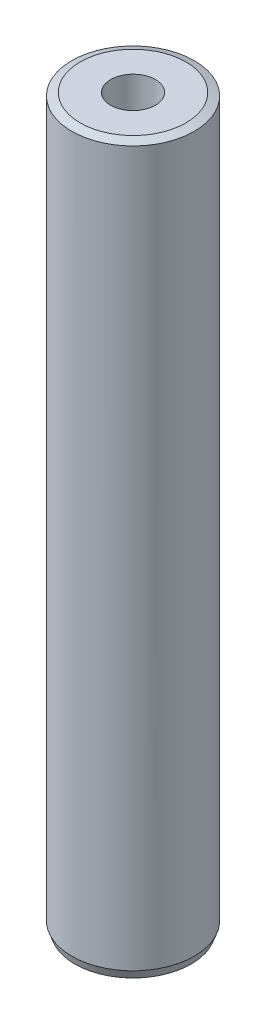
ISO-10303-21;
HEADER;
FILE_DESCRIPTION(('STEP AP214'),'2;1');
FILE_NAME('part.step','',(''),(''),'','','');
FILE_SCHEMA(('AUTOMOTIVE_DESIGN { 1 0 10303 214 1 1 1 1 }'));
ENDSEC;
DATA;
#1=APPLICATION_CONTEXT('core data for automotive mechanical design processes');
#2=APPLICATION_PROTOCOL_DEFINITION('international standard','automotive_design',2000,#1);
#3=PRODUCT_CONTEXT('',#1,'mechanical');
#4=PRODUCT('Part','Part','',(#3));
#5=PRODUCT_RELATED_PRODUCT_CATEGORY('part','',(#4));
#6=PRODUCT_DEFINITION_FORMATION('','',#4);
#7=PRODUCT_DEFINITION_CONTEXT('part definition',#1,'design');
#8=PRODUCT_DEFINITION('design','',#6,#7);
#9=PRODUCT_DEFINITION_SHAPE('','',#8);
#10=(LENGTH_UNIT() NAMED_UNIT(*) SI_UNIT(.MILLI.,.METRE.));
#11=(NAMED_UNIT(*) PLANE_ANGLE_UNIT() SI_UNIT($,.RADIAN.));
#12=(NAMED_UNIT(*) SI_UNIT($,.STERADIAN.) SOLID_ANGLE_UNIT());
#13=UNCERTAINTY_MEASURE_WITH_UNIT(LENGTH_MEASURE(1.E-05),#10,'distance_accuracy_value','');
#14=(GEOMETRIC_REPRESENTATION_CONTEXT(3) GLOBAL_UNCERTAINTY_ASSIGNED_CONTEXT((#13)) GLOBAL_UNIT_ASSIGNED_CONTEXT((#10,
#11,#12)) REPRESENTATION_CONTEXT('',''));
#15=CARTESIAN_POINT('',(0.,0.,0.));
#16=DIRECTION('',(0.,0.,1.));
#17=DIRECTION('',(1.,0.,0.));
#18=AXIS2_PLACEMENT_3D('',#15,#16,#17);
#19=CARTESIAN_POINT('',(0.,473.883408046253,0.));
#20=DIRECTION('',(0.,-1.,0.));
#21=DIRECTION('',(0.,0.,-1.));
#22=AXIS2_PLACEMENT_3D('',#19,#20,#21);
#23=CYLINDRICAL_SURFACE('',#22,40.);
#24=CARTESIAN_POINT('',(0.,471.868378961336,0.));
#25=DIRECTION('',(0.,1.,0.));
#26=DIRECTION('',(0.,0.,1.));
#27=AXIS2_PLACEMENT_3D('',#24,#25,#26);
#28=CIRCLE('',#27,40.);
#29=CARTESIAN_POINT('',(0.,471.868378961336,-40.));
#30=VERTEX_POINT('',#29);
#31=EDGE_CURVE('E50',#30,#30,#28,.F.);
#32=CARTESIAN_POINT('',(0.,5.48846768249406,0.));
#33=DIRECTION('',(0.,1.,0.));
#34=DIRECTION('',(0.,0.,1.));
#35=AXIS2_PLACEMENT_3D('',#32,#33,#34);
#36=CIRCLE('',#35,40.);
#37=CARTESIAN_POINT('',(0.,5.488467682494,-40.));
#38=VERTEX_POINT('',#37);
#39=EDGE_CURVE('E51',#38,#38,#36,.T.);
#40=CARTESIAN_POINT('',(0.,471.868378961336,-40.));
#41=CARTESIAN_POINT('',(0.,467.010254885514,-40.));
#42=CARTESIAN_POINT('',(0.,462.152130809693,-40.));
#43=CARTESIAN_POINT('',(0.,452.435882658051,-40.));
#44=CARTESIAN_POINT('',(0.,447.577758582229,-40.));
#45=CARTESIAN_POINT('',(0.,437.861510430587,-40.));
#46=CARTESIAN_POINT('',(0.,433.003386354766,-40.));
#47=CARTESIAN_POINT('',(0.,423.287138203123,-40.));
#48=CARTESIAN_POINT('',(0.,418.429014127302,-40.));
#49=CARTESIAN_POINT('',(0.,408.712765975659,-40.));
#50=CARTESIAN_POINT('',(0.,403.854641899838,-40.));
#51=CARTESIAN_POINT('',(0.,394.138393748196,-40.));
#52=CARTESIAN_POINT('',(0.,389.280269672374,-40.));
#53=CARTESIAN_POINT('',(0.,379.564021520732,-40.));
#54=CARTESIAN_POINT('',(0.,374.70589744491,-40.));
#55=CARTESIAN_POINT('',(0.,364.989649293268,-40.));
#56=CARTESIAN_POINT('',(0.,360.131525217447,-40.));
#57=CARTESIAN_POINT('',(0.,350.415277065804,-40.));
#58=CARTESIAN_POINT('',(0.,345.557152989983,-40.));
#59=CARTESIAN_POINT('',(0.,335.84090483834,-40.));
#60=CARTESIAN_POINT('',(0.,330.982780762519,-40.));
#61=CARTESIAN_POINT('',(0.,321.266532610876,-40.));
#62=CARTESIAN_POINT('',(0.,316.408408535055,-40.));
#63=CARTESIAN_POINT('',(0.,306.692160383413,-40.));
#64=CARTESIAN_POINT('',(0.,301.834036307591,-40.));
#65=CARTESIAN_POINT('',(0.,292.117788155949,-40.));
#66=CARTESIAN_POINT('',(0.,287.259664080128,-40.));
#67=CARTESIAN_POINT('',(0.,277.543415928485,-40.));
#68=CARTESIAN_POINT('',(0.,272.685291852664,-40.));
#69=CARTESIAN_POINT('',(0.,262.969043701021,-40.));
#70=CARTESIAN_POINT('',(0.,258.1109196252,-40.));
#71=CARTESIAN_POINT('',(0.,248.394671473557,-40.));
#72=CARTESIAN_POINT('',(0.,243.536547397736,-40.));
#73=CARTESIAN_POINT('',(0.,233.820299246094,-40.));
#74=CARTESIAN_POINT('',(0.,228.962175170272,-40.));
#75=CARTESIAN_POINT('',(0.,219.24592701863,-40.));
#76=CARTESIAN_POINT('',(0.,214.387802942809,-40.));
#77=CARTESIAN_POINT('',(0.,204.671554791166,-40.));
#78=CARTESIAN_POINT('',(0.,199.813430715345,-40.));
#79=CARTESIAN_POINT('',(0.,190.097182563702,-40.));
#80=CARTESIAN_POINT('',(0.,185.239058487881,-40.));
#81=CARTESIAN_POINT('',(0.,175.522810336238,-40.));
#82=CARTESIAN_POINT('',(0.,170.664686260417,-40.));
#83=CARTESIAN_POINT('',(0.,160.948438108775,-40.));
#84=CARTESIAN_POINT('',(0.,156.090314032953,-40.));
#85=CARTESIAN_POINT('',(0.,146.374065881311,-40.));
#86=CARTESIAN_POINT('',(0.,141.51594180549,-40.));
#87=CARTESIAN_POINT('',(0.,131.799693653847,-40.));
#88=CARTESIAN_POINT('',(0.,126.941569578026,-40.));
#89=CARTESIAN_POINT('',(0.,117.225321426383,-40.));
#90=CARTESIAN_POINT('',(0.,112.367197350562,-40.));
#91=CARTESIAN_POINT('',(0.,102.650949198919,-40.));
#92=CARTESIAN_POINT('',(0.,97.7928251230981,-40.));
#93=CARTESIAN_POINT('',(0.,88.0765769714556,-40.));
#94=CARTESIAN_POINT('',(0.,83.2184528956343,-40.));
#95=CARTESIAN_POINT('',(0.,73.5022047439918,-40.));
#96=CARTESIAN_POINT('',(0.,68.6440806681705,-40.));
#97=CARTESIAN_POINT('',(0.,58.9278325165279,-40.));
#98=CARTESIAN_POINT('',(0.,54.0697084407067,-40.));
#99=CARTESIAN_POINT('',(0.,44.3534602890642,-40.));
#100=CARTESIAN_POINT('',(0.,39.4953362132429,-40.));
#101=CARTESIAN_POINT('',(0.,29.7790880616003,-40.));
#102=CARTESIAN_POINT('',(0.,24.9209639857791,-40.));
#103=CARTESIAN_POINT('',(0.,15.2047158341366,-40.));
#104=CARTESIAN_POINT('',(0.,10.3465917583153,-40.));
#105=CARTESIAN_POINT('',(0.,5.488467682494,-40.));
#106=B_SPLINE_CURVE_WITH_KNOTS('',3,(#40,#41,#42,#43,#44,#45,#46,#47,#48,#49,#50,#51,#52,#53,
#54,#55,#56,#57,#58,#59,#60,#61,#62,#63,#64,#65,#66,#67,#68,#69,#70,#71,#72,#73,#74,#75,#76,#77,
#78,#79,#80,#81,#82,#83,#84,#85,#86,#87,#88,#89,#90,#91,#92,#93,#94,#95,#96,#97,#98,#99,#100,
#101,#102,#103,#104,#105),.UNSPECIFIED.,.F.,.F.,(4,2,2,2,2,2,2,2,2,2,2,2,2,2,2,2,2,2,2,2,2,2,2,
2,2,2,2,2,2,2,2,2,4),(0.,14.5743722274638,29.1487444549276,43.7231166823914,58.2974889098552,
72.871861137319,87.4462333647828,102.020605592247,116.59497781971,131.169350047174,
145.743722274638,160.318094502102,174.892466729566,189.466838957029,204.041211184493,
218.615583411957,233.189955639421,247.764327866885,262.338700094348,276.913072321812,
291.487444549276,306.06181677674,320.636189004204,335.210561231667,349.784933459131,
364.359305686595,378.933677914059,393.508050141523,408.082422368987,422.65679459645,
437.231166823914,451.805539051378,466.379911278842),.UNSPECIFIED.);
#107=EDGE_CURVE('BSEAM39',#30,#38,#106,.T.);
#108=ORIENTED_EDGE('',*,*,#31,.T.);
#109=ORIENTED_EDGE('',*,*,#39,.T.);
#110=ORIENTED_EDGE('',*,*,#107,.T.);
#111=ORIENTED_EDGE('',*,*,#107,.F.);
#112=EDGE_LOOP('',(#108,#110,#109,#111));
#113=FACE_BOUND('',#112,.T.);
#114=ADVANCED_FACE('F39',(#113),#23,.T.);
#115=CARTESIAN_POINT('',(0.,473.883408046253,0.));
#116=DIRECTION('',(0.,1.,0.));
#117=DIRECTION('',(0.,0.,1.));
#118=AXIS2_PLACEMENT_3D('',#115,#116,#117);
#119=PLANE('',#118);
#120=CARTESIAN_POINT('',(0.,473.883408046253,0.));
#121=DIRECTION('',(0.,1.,0.));
#122=DIRECTION('',(0.,0.,1.));
#123=AXIS2_PLACEMENT_3D('',#120,#121,#122);
#124=CIRCLE('',#123,34.5115323175077);
#125=CARTESIAN_POINT('',(0.,473.883408046253,34.5115323175077));
#126=VERTEX_POINT('',#125);
#127=EDGE_CURVE('E54',#126,#126,#124,.T.);
#128=ORIENTED_EDGE('',*,*,#127,.T.);
#129=EDGE_LOOP('',(#128));
#130=FACE_BOUND('',#129,.T.);
#131=CARTESIAN_POINT('',(0.,473.883408046253,0.));
#132=DIRECTION('',(0.,1.,0.));
#133=DIRECTION('',(0.,0.,1.));
#134=AXIS2_PLACEMENT_3D('',#131,#132,#133);
#135=CIRCLE('',#134,14.5886950579079);
#136=CARTESIAN_POINT('',(0.,473.883408046253,-14.5886950579079));
#137=VERTEX_POINT('',#136);
#138=EDGE_CURVE('E58',#137,#137,#135,.T.);
#139=ORIENTED_EDGE('',*,*,#138,.F.);
#140=EDGE_LOOP('',(#139));
#141=FACE_BOUND('',#140,.T.);
#142=ADVANCED_FACE('F69',(#130,#141),#119,.T.);
#143=CARTESIAN_POINT('',(0.,0.,0.));
#144=DIRECTION('',(0.,1.,0.));
#145=DIRECTION('',(0.,0.,1.));
#146=AXIS2_PLACEMENT_3D('',#143,#144,#145);
#147=PLANE('',#146);
#148=CARTESIAN_POINT('',(0.,0.,0.));
#149=DIRECTION('',(0.,1.,0.));
#150=DIRECTION('',(0.,0.,1.));
#151=AXIS2_PLACEMENT_3D('',#148,#149,#150);
#152=CIRCLE('',#151,37.9849709150825);
#153=CARTESIAN_POINT('',(0.,0.,37.9849709150825));
#154=VERTEX_POINT('',#153);
#155=EDGE_CURVE('E10',#154,#154,#152,.F.);
#156=ORIENTED_EDGE('',*,*,#155,.T.);
#157=EDGE_LOOP('',(#156));
#158=FACE_BOUND('',#157,.T.);
#159=CARTESIAN_POINT('',(0.,0.,0.));
#160=DIRECTION('',(0.,1.,0.));
#161=DIRECTION('',(0.,0.,1.));
#162=AXIS2_PLACEMENT_3D('',#159,#160,#161);
#163=CIRCLE('',#162,14.5886950579079);
#164=CARTESIAN_POINT('',(0.,0.,-14.5886950579079));
#165=VERTEX_POINT('',#164);
#166=EDGE_CURVE('E63',#165,#165,#163,.T.);
#167=ORIENTED_EDGE('',*,*,#166,.T.);
#168=EDGE_LOOP('',(#167));
#169=FACE_BOUND('',#168,.T.);
#170=ADVANCED_FACE('F75',(#158,#169),#147,.F.);
#171=CARTESIAN_POINT('',(0.,473.883408046253,0.));
#172=DIRECTION('',(0.,-1.,0.));
#173=DIRECTION('',(0.,0.,-1.));
#174=AXIS2_PLACEMENT_3D('',#171,#172,#173);
#175=CYLINDRICAL_SURFACE('',#174,14.5886950579079);
#176=CARTESIAN_POINT('',(0.,473.883408046253,-14.5886950579079));
#177=CARTESIAN_POINT('',(0.,468.947122545771,-14.5886950579079));
#178=CARTESIAN_POINT('',(0.,464.010837045289,-14.5886950579079));
#179=CARTESIAN_POINT('',(0.,454.138266044325,-14.5886950579079));
#180=CARTESIAN_POINT('',(0.,449.201980543844,-14.5886950579079));
#181=CARTESIAN_POINT('',(0.,439.32940954288,-14.5886950579079));
#182=CARTESIAN_POINT('',(0.,434.393124042398,-14.5886950579079));
#183=CARTESIAN_POINT('',(0.,424.520553041435,-14.5886950579079));
#184=CARTESIAN_POINT('',(0.,419.584267540953,-14.5886950579079));
#185=CARTESIAN_POINT('',(0.,409.711696539989,-14.5886950579079));
#186=CARTESIAN_POINT('',(0.,404.775411039508,-14.5886950579079));
#187=CARTESIAN_POINT('',(0.,394.902840038544,-14.5886950579079));
#188=CARTESIAN_POINT('',(0.,389.966554538062,-14.5886950579079));
#189=CARTESIAN_POINT('',(0.,380.093983537098,-14.5886950579079));
#190=CARTESIAN_POINT('',(0.,375.157698036617,-14.5886950579079));
#191=CARTESIAN_POINT('',(0.,365.285127035653,-14.5886950579079));
#192=CARTESIAN_POINT('',(0.,360.348841535171,-14.5886950579079));
#193=CARTESIAN_POINT('',(0.,350.476270534208,-14.5886950579079));
#194=CARTESIAN_POINT('',(0.,345.539985033726,-14.5886950579079));
#195=CARTESIAN_POINT('',(0.,335.667414032762,-14.5886950579079));
#196=CARTESIAN_POINT('',(0.,330.731128532281,-14.5886950579079));
#197=CARTESIAN_POINT('',(0.,320.858557531317,-14.5886950579079));
#198=CARTESIAN_POINT('',(0.,315.922272030835,-14.5886950579079));
#199=CARTESIAN_POINT('',(0.,306.049701029872,-14.5886950579079));
#200=CARTESIAN_POINT('',(0.,301.11341552939,-14.5886950579079));
#201=CARTESIAN_POINT('',(0.,291.240844528426,-14.5886950579079));
#202=CARTESIAN_POINT('',(0.,286.304559027944,-14.5886950579079));
#203=CARTESIAN_POINT('',(0.,276.431988026981,-14.5886950579079));
#204=CARTESIAN_POINT('',(0.,271.495702526499,-14.5886950579079));
#205=CARTESIAN_POINT('',(0.,261.623131525535,-14.5886950579079));
#206=CARTESIAN_POINT('',(0.,256.686846025054,-14.5886950579079));
#207=CARTESIAN_POINT('',(0.,246.81427502409,-14.5886950579079));
#208=CARTESIAN_POINT('',(0.,241.877989523608,-14.5886950579079));
#209=CARTESIAN_POINT('',(0.,232.005418522645,-14.5886950579079));
#210=CARTESIAN_POINT('',(0.,227.069133022163,-14.5886950579079));
#211=CARTESIAN_POINT('',(0.,217.196562021199,-14.5886950579079));
#212=CARTESIAN_POINT('',(0.,212.260276520717,-14.5886950579079));
#213=CARTESIAN_POINT('',(0.,202.387705519754,-14.5886950579079));
#214=CARTESIAN_POINT('',(0.,197.451420019272,-14.5886950579079));
#215=CARTESIAN_POINT('',(0.,187.578849018308,-14.5886950579079));
#216=CARTESIAN_POINT('',(0.,182.642563517827,-14.5886950579079));
#217=CARTESIAN_POINT('',(0.,172.769992516863,-14.5886950579079));
#218=CARTESIAN_POINT('',(0.,167.833707016381,-14.5886950579079));
#219=CARTESIAN_POINT('',(0.,157.961136015418,-14.5886950579079));
#220=CARTESIAN_POINT('',(0.,153.024850514936,-14.5886950579079));
#221=CARTESIAN_POINT('',(0.,143.152279513972,-14.5886950579079));
#222=CARTESIAN_POINT('',(0.,138.21599401349,-14.5886950579079));
#223=CARTESIAN_POINT('',(0.,128.343423012527,-14.5886950579079));
#224=CARTESIAN_POINT('',(0.,123.407137512045,-14.5886950579079));
#225=CARTESIAN_POINT('',(0.,113.534566511081,-14.5886950579079));
#226=CARTESIAN_POINT('',(0.,108.5982810106,-14.5886950579079));
#227=CARTESIAN_POINT('',(0.,98.725710009636,-14.5886950579079));
#228=CARTESIAN_POINT('',(0.,93.7894245091542,-14.5886950579079));
#229=CARTESIAN_POINT('',(0.,83.9168535081906,-14.5886950579079));
#230=CARTESIAN_POINT('',(0.,78.9805680077088,-14.5886950579079));
#231=CARTESIAN_POINT('',(0.,69.1079970067452,-14.5886950579079));
#232=CARTESIAN_POINT('',(0.,64.1717115062634,-14.5886950579079));
#233=CARTESIAN_POINT('',(0.,54.2991405052998,-14.5886950579079));
#234=CARTESIAN_POINT('',(0.,49.362855004818,-14.5886950579079));
#235=CARTESIAN_POINT('',(0.,39.4902840038544,-14.5886950579079));
#236=CARTESIAN_POINT('',(0.,34.5539985033726,-14.5886950579079));
#237=CARTESIAN_POINT('',(0.,24.681427502409,-14.5886950579079));
#238=CARTESIAN_POINT('',(0.,19.7451420019272,-14.5886950579079));
#239=CARTESIAN_POINT('',(0.,9.87257100096361,-14.5886950579079));
#240=CARTESIAN_POINT('',(0.,4.93628550048181,-14.5886950579079));
#241=CARTESIAN_POINT('',(0.,0.,-14.5886950579079));
#242=B_SPLINE_CURVE_WITH_KNOTS('',3,(#176,#177,#178,#179,#180,#181,#182,#183,#184,#185,#186,
#187,#188,#189,#190,#191,#192,#193,#194,#195,#196,#197,#198,#199,#200,#201,#202,#203,#204,#205,
#206,#207,#208,#209,#210,#211,#212,#213,#214,#215,#216,#217,#218,#219,#220,#221,#222,#223,#224,
#225,#226,#227,#228,#229,#230,#231,#232,#233,#234,#235,#236,#237,#238,#239,#240,#241),
.UNSPECIFIED.,.F.,.F.,(4,2,2,2,2,2,2,2,2,2,2,2,2,2,2,2,2,2,2,2,2,2,2,2,2,2,2,2,2,2,2,2,4),(0.,
14.8088565014454,29.6177130028907,44.4265695043362,59.2354260057816,74.0442825072269,
88.8531390086723,103.661995510118,118.470852011563,133.279708513009,148.088565014454,
162.897421515899,177.706278017345,192.51513451879,207.323991020235,222.132847521681,
236.941704023126,251.750560524572,266.559417026017,281.368273527462,296.177130028908,
310.985986530353,325.794843031799,340.603699533244,355.412556034689,370.221412536135,
385.03026903758,399.839125539026,414.647982040471,429.456838541916,444.265695043362,
459.074551544807,473.883408046253),.UNSPECIFIED.);
#243=EDGE_CURVE('BSEAM70',#137,#165,#242,.T.);
#244=ORIENTED_EDGE('',*,*,#138,.T.);
#245=ORIENTED_EDGE('',*,*,#166,.F.);
#246=ORIENTED_EDGE('',*,*,#243,.T.);
#247=ORIENTED_EDGE('',*,*,#243,.F.);
#248=EDGE_LOOP('',(#244,#246,#245,#247));
#249=FACE_BOUND('',#248,.T.);
#250=ADVANCED_FACE('F70',(#249),#175,.F.);
#251=CARTESIAN_POINT('',(0.,473.883408046253,0.));
#252=DIRECTION('',(0.,-1.,0.));
#253=DIRECTION('',(0.,0.,-1.));
#254=AXIS2_PLACEMENT_3D('',#251,#252,#253);
#255=CONICAL_SURFACE('',#254,34.5115323175077,1.2189354729162);
#256=ORIENTED_EDGE('',*,*,#31,.F.);
#257=EDGE_LOOP('',(#256));
#258=FACE_BOUND('',#257,.T.);
#259=ORIENTED_EDGE('',*,*,#127,.F.);
#260=EDGE_LOOP('',(#259));
#261=FACE_BOUND('',#260,.T.);
#262=ADVANCED_FACE('F81',(#258,#261),#255,.T.);
#263=CARTESIAN_POINT('',(0.,5.48846768249406,0.));
#264=DIRECTION('',(0.,1.,0.));
#265=DIRECTION('',(0.,0.,1.));
#266=AXIS2_PLACEMENT_3D('',#263,#264,#265);
#267=CONICAL_SURFACE('',#266,40.,0.351860853878702);
#268=ORIENTED_EDGE('',*,*,#155,.F.);
#269=EDGE_LOOP('',(#268));
#270=FACE_BOUND('',#269,.T.);
#271=ORIENTED_EDGE('',*,*,#39,.F.);
#272=EDGE_LOOP('',(#271));
#273=FACE_BOUND('',#272,.T.);
#274=ADVANCED_FACE('F45',(#270,#273),#267,.T.);
#275=CLOSED_SHELL('',(#114,#142,#170,#250,#262,#274));
#276=MANIFOLD_SOLID_BREP('B2',#275);
#277=ADVANCED_BREP_SHAPE_REPRESENTATION('',(#18,#276),#14);
#278=SHAPE_DEFINITION_REPRESENTATION(#9,#277);
ENDSEC;
END-ISO-10303-21;
